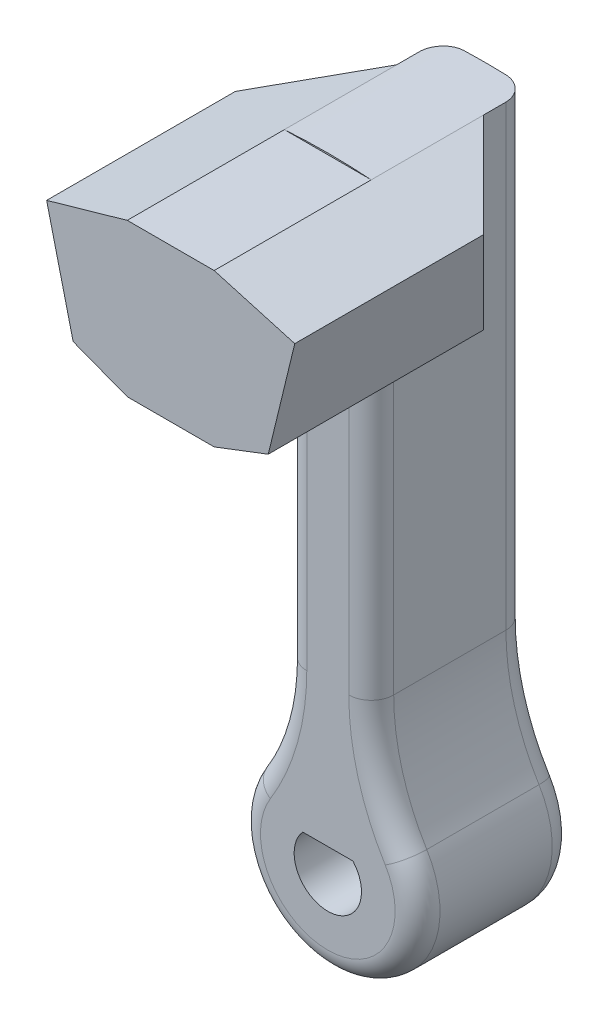
ISO-10303-21;
HEADER;
FILE_DESCRIPTION(('STEP AP214'),'2;1');
FILE_NAME('part.step','',(''),(''),'','','');
FILE_SCHEMA(('AUTOMOTIVE_DESIGN { 1 0 10303 214 1 1 1 1 }'));
ENDSEC;
DATA;
#1=APPLICATION_CONTEXT('core data for automotive mechanical design processes');
#2=APPLICATION_PROTOCOL_DEFINITION('international standard','automotive_design',2000,#1);
#3=PRODUCT_CONTEXT('',#1,'mechanical');
#4=PRODUCT('Part','Part','',(#3));
#5=PRODUCT_RELATED_PRODUCT_CATEGORY('part','',(#4));
#6=PRODUCT_DEFINITION_FORMATION('','',#4);
#7=PRODUCT_DEFINITION_CONTEXT('part definition',#1,'design');
#8=PRODUCT_DEFINITION('design','',#6,#7);
#9=PRODUCT_DEFINITION_SHAPE('','',#8);
#10=(LENGTH_UNIT() NAMED_UNIT(*) SI_UNIT(.MILLI.,.METRE.));
#11=(NAMED_UNIT(*) PLANE_ANGLE_UNIT() SI_UNIT($,.RADIAN.));
#12=(NAMED_UNIT(*) SI_UNIT($,.STERADIAN.) SOLID_ANGLE_UNIT());
#13=UNCERTAINTY_MEASURE_WITH_UNIT(LENGTH_MEASURE(1.E-05),#10,'distance_accuracy_value','');
#14=(GEOMETRIC_REPRESENTATION_CONTEXT(3) GLOBAL_UNCERTAINTY_ASSIGNED_CONTEXT((#13)) GLOBAL_UNIT_ASSIGNED_CONTEXT((#10,
#11,#12)) REPRESENTATION_CONTEXT('',''));
#15=CARTESIAN_POINT('',(0.,0.,0.));
#16=DIRECTION('',(0.,0.,1.));
#17=DIRECTION('',(1.,0.,0.));
#18=AXIS2_PLACEMENT_3D('',#15,#16,#17);
#19=CARTESIAN_POINT('',(-27.2528800262718,-5.01688961354067,21.2500000985339));
#20=DIRECTION('',(0.,0.,1.));
#21=DIRECTION('',(1.,0.,0.));
#22=AXIS2_PLACEMENT_3D('',#19,#20,#21);
#23=PLANE('',#22);
#24=CARTESIAN_POINT('',(-27.2528800262718,-5.01688961354067,21.2500000985339));
#25=DIRECTION('',(0.,0.,-1.));
#26=DIRECTION('',(-1.,0.,0.));
#27=AXIS2_PLACEMENT_3D('',#24,#25,#26);
#28=CIRCLE('',#27,27.7611237041775);
#29=CARTESIAN_POINT('',(-29.1893716993755,22.6766112362733,21.2500000985339));
#30=VERTEX_POINT('',#29);
#31=CARTESIAN_POINT('',(-25.316388353168,22.6766112362733,21.2500000985339));
#32=VERTEX_POINT('',#31);
#33=EDGE_CURVE('E146',#30,#32,#28,.T.);
#34=ORIENTED_EDGE('',*,*,#33,.F.);
#35=DIRECTION('',(1.,0.,0.));
#36=VECTOR('',#35,1.);
#37=CARTESIAN_POINT('',(-25.316388353168,22.6766112362733,21.2500000985339));
#38=LINE('',#37,#36);
#39=EDGE_CURVE('E157',#30,#32,#38,.T.);
#40=ORIENTED_EDGE('',*,*,#39,.T.);
#41=EDGE_LOOP('',(#34,#40));
#42=FACE_BOUND('',#41,.T.);
#43=ADVANCED_FACE('F43',(#42),#23,.T.);
#44=CARTESIAN_POINT('',(-27.2528800262718,-5.01688961354067,21.2500000985339));
#45=DIRECTION('',(0.,0.,1.));
#46=DIRECTION('',(1.,0.,0.));
#47=AXIS2_PLACEMENT_3D('',#44,#45,#46);
#48=CIRCLE('',#47,1.5);
#49=CARTESIAN_POINT('',(-28.3709140150216,-4.01688961354067,21.2500000985339));
#50=VERTEX_POINT('',#49);
#51=CARTESIAN_POINT('',(-26.1348460375219,-4.01688961354067,21.2500000985339));
#52=VERTEX_POINT('',#51);
#53=EDGE_CURVE('E193',#50,#52,#48,.T.);
#54=ORIENTED_EDGE('',*,*,#53,.F.);
#55=DIRECTION('',(-1.,0.,0.));
#56=VECTOR('',#55,1.);
#57=CARTESIAN_POINT('',(-26.1348460375219,-4.01688961354067,21.2500000985339));
#58=LINE('',#57,#56);
#59=EDGE_CURVE('E200',#52,#50,#58,.T.);
#60=ORIENTED_EDGE('',*,*,#59,.F.);
#61=EDGE_LOOP('',(#54,#60));
#62=FACE_BOUND('',#61,.T.);
#63=CARTESIAN_POINT('',(-15.316388353168,2.29885823189016,21.2500000985339));
#64=DIRECTION('',(0.,0.,1.));
#65=DIRECTION('',(1.,0.,0.));
#66=AXIS2_PLACEMENT_3D('',#63,#64,#65);
#67=CIRCLE('',#66,11.);
#68=CARTESIAN_POINT('',(-24.6950603820352,-3.44922936094834,21.2500000985339));
#69=VERTEX_POINT('',#68);
#70=CARTESIAN_POINT('',(-26.316388353168,2.29885823189016,21.2500000985339));
#71=VERTEX_POINT('',#70);
#72=EDGE_CURVE('E366',#69,#71,#67,.F.);
#73=ORIENTED_EDGE('',*,*,#72,.T.);
#74=DIRECTION('',(0.,-1.,0.));
#75=VECTOR('',#74,1.);
#76=CARTESIAN_POINT('',(-26.316388353168,-5.01688961354067,21.2500000985339));
#77=LINE('',#76,#75);
#78=CARTESIAN_POINT('',(-26.316388353168,15.8699735180172,21.2500000985339));
#79=VERTEX_POINT('',#78);
#80=EDGE_CURVE('E369',#71,#79,#77,.F.);
#81=ORIENTED_EDGE('',*,*,#80,.T.);
#82=DIRECTION('',(-1.,0.,0.));
#83=VECTOR('',#82,1.);
#84=CARTESIAN_POINT('',(-25.316388353168,15.8699735180172,21.2500000985339));
#85=LINE('',#84,#83);
#86=CARTESIAN_POINT('',(-28.1893716993755,15.8699735180172,21.2500000985339));
#87=VERTEX_POINT('',#86);
#88=EDGE_CURVE('E163',#79,#87,#85,.T.);
#89=ORIENTED_EDGE('',*,*,#88,.T.);
#90=DIRECTION('',(0.,1.,0.));
#91=VECTOR('',#90,1.);
#92=CARTESIAN_POINT('',(-28.1893716993755,-5.01688961354067,21.2500000985339));
#93=LINE('',#92,#91);
#94=CARTESIAN_POINT('',(-28.1893716993755,2.29885823189016,21.2500000985339));
#95=VERTEX_POINT('',#94);
#96=EDGE_CURVE('E357',#87,#95,#93,.F.);
#97=ORIENTED_EDGE('',*,*,#96,.T.);
#98=CARTESIAN_POINT('',(-39.1893716993755,2.29885823189016,21.2500000985339));
#99=DIRECTION('',(0.,0.,1.));
#100=DIRECTION('',(1.,0.,0.));
#101=AXIS2_PLACEMENT_3D('',#98,#99,#100);
#102=CIRCLE('',#101,11.);
#103=CARTESIAN_POINT('',(-29.8106996705083,-3.44922936094834,21.2500000985339));
#104=VERTEX_POINT('',#103);
#105=EDGE_CURVE('E360',#95,#104,#102,.F.);
#106=ORIENTED_EDGE('',*,*,#105,.T.);
#107=CARTESIAN_POINT('',(-27.2528800262718,-5.01688961354067,21.2500000985339));
#108=DIRECTION('',(0.,0.,1.));
#109=DIRECTION('',(1.,0.,0.));
#110=AXIS2_PLACEMENT_3D('',#107,#108,#109);
#111=CIRCLE('',#110,3.);
#112=EDGE_CURVE('E363',#104,#69,#111,.T.);
#113=ORIENTED_EDGE('',*,*,#112,.T.);
#114=EDGE_LOOP('',(#73,#81,#89,#97,#106,#113));
#115=FACE_BOUND('',#114,.T.);
#116=ADVANCED_FACE('F295',(#62,#115),#23,.T.);
#117=CARTESIAN_POINT('',(-27.2528800262718,-5.01688961354067,14.2500000985339));
#118=DIRECTION('',(0.,0.,1.));
#119=DIRECTION('',(1.,0.,0.));
#120=AXIS2_PLACEMENT_3D('',#117,#118,#119);
#121=CYLINDRICAL_SURFACE('',#120,4.);
#122=DIRECTION('',(0.,0.,1.));
#123=VECTOR('',#122,1.);
#124=CARTESIAN_POINT('',(-23.8424538339564,-2.92667594341757,14.2500000985339));
#125=LINE('',#124,#123);
#126=CARTESIAN_POINT('',(-23.8424538339564,-2.92667594341757,15.2500000985339));
#127=VERTEX_POINT('',#126);
#128=CARTESIAN_POINT('',(-23.8424538339564,-2.92667594341757,20.2500000985339));
#129=VERTEX_POINT('',#128);
#130=EDGE_CURVE('E216',#127,#129,#125,.T.);
#131=ORIENTED_EDGE('',*,*,#130,.T.);
#132=CARTESIAN_POINT('',(-27.2528800262718,-5.01688961354067,20.2500000985339));
#133=DIRECTION('',(0.,0.,1.));
#134=DIRECTION('',(1.,0.,0.));
#135=AXIS2_PLACEMENT_3D('',#132,#133,#134);
#136=CIRCLE('',#135,4.);
#137=CARTESIAN_POINT('',(-30.6633062185871,-2.92667594341757,20.2500000985339));
#138=VERTEX_POINT('',#137);
#139=EDGE_CURVE('E375',#129,#138,#136,.F.);
#140=ORIENTED_EDGE('',*,*,#139,.T.);
#141=DIRECTION('',(0.,0.,1.));
#142=VECTOR('',#141,1.);
#143=CARTESIAN_POINT('',(-30.6633062185871,-2.92667594341757,14.2500000985339));
#144=LINE('',#143,#142);
#145=CARTESIAN_POINT('',(-30.6633062185871,-2.92667594341757,15.2500000985339));
#146=VERTEX_POINT('',#145);
#147=EDGE_CURVE('E219',#138,#146,#144,.F.);
#148=ORIENTED_EDGE('',*,*,#147,.T.);
#149=CARTESIAN_POINT('',(-27.2528800262718,-5.01688961354067,15.2500000985339));
#150=DIRECTION('',(0.,0.,1.));
#151=DIRECTION('',(1.,0.,0.));
#152=AXIS2_PLACEMENT_3D('',#149,#150,#151);
#153=CIRCLE('',#152,4.);
#154=EDGE_CURVE('E340',#146,#127,#153,.T.);
#155=ORIENTED_EDGE('',*,*,#154,.T.);
#156=EDGE_LOOP('',(#131,#140,#148,#155));
#157=FACE_BOUND('',#156,.T.);
#158=ADVANCED_FACE('F302',(#157),#121,.T.);
#159=CARTESIAN_POINT('',(-27.2528800262718,-5.01688961354067,14.2500000985339));
#160=DIRECTION('',(0.,0.,1.));
#161=DIRECTION('',(1.,0.,0.));
#162=AXIS2_PLACEMENT_3D('',#159,#160,#161);
#163=PLANE('',#162);
#164=DIRECTION('',(-1.,0.,0.));
#165=VECTOR('',#164,1.);
#166=CARTESIAN_POINT('',(-26.1348460375219,-4.01688961354067,14.2500000985339));
#167=LINE('',#166,#165);
#168=CARTESIAN_POINT('',(-26.1348460375219,-4.01688961354067,14.2500000985339));
#169=VERTEX_POINT('',#168);
#170=CARTESIAN_POINT('',(-28.3709140150216,-4.01688961354067,14.2500000985339));
#171=VERTEX_POINT('',#170);
#172=EDGE_CURVE('E199',#169,#171,#167,.T.);
#173=ORIENTED_EDGE('',*,*,#172,.T.);
#174=CARTESIAN_POINT('',(-27.2528800262718,-5.01688961354067,14.2500000985339));
#175=DIRECTION('',(0.,0.,1.));
#176=DIRECTION('',(1.,0.,0.));
#177=AXIS2_PLACEMENT_3D('',#174,#175,#176);
#178=CIRCLE('',#177,1.5);
#179=EDGE_CURVE('E196',#171,#169,#178,.T.);
#180=ORIENTED_EDGE('',*,*,#179,.T.);
#181=EDGE_LOOP('',(#173,#180));
#182=FACE_BOUND('',#181,.T.);
#183=CARTESIAN_POINT('',(-39.1893716993755,2.29885823189016,14.2500000985339));
#184=DIRECTION('',(0.,0.,1.));
#185=DIRECTION('',(1.,0.,0.));
#186=AXIS2_PLACEMENT_3D('',#183,#184,#185);
#187=CIRCLE('',#186,11.);
#188=CARTESIAN_POINT('',(-29.8106996705083,-3.44922936094834,14.2500000985339));
#189=VERTEX_POINT('',#188);
#190=CARTESIAN_POINT('',(-28.1893716993755,2.29885823189016,14.2500000985339));
#191=VERTEX_POINT('',#190);
#192=EDGE_CURVE('E234',#189,#191,#187,.T.);
#193=ORIENTED_EDGE('',*,*,#192,.T.);
#194=DIRECTION('',(0.,1.,0.));
#195=VECTOR('',#194,1.);
#196=CARTESIAN_POINT('',(-28.1893716993755,22.6766112362733,14.2500000985339));
#197=LINE('',#196,#195);
#198=CARTESIAN_POINT('',(-28.1893716993755,22.7284338242002,14.2500000985339));
#199=VERTEX_POINT('',#198);
#200=EDGE_CURVE('E237',#191,#199,#197,.T.);
#201=ORIENTED_EDGE('',*,*,#200,.T.);
#202=CARTESIAN_POINT('',(-27.2528800262718,-5.01688961354067,14.2500000985339));
#203=DIRECTION('',(0.,0.,-1.));
#204=DIRECTION('',(-1.,0.,0.));
#205=AXIS2_PLACEMENT_3D('',#202,#203,#204);
#206=CIRCLE('',#205,27.7611237041775);
#207=CARTESIAN_POINT('',(-26.316388353168,22.7284338242002,14.2500000985339));
#208=VERTEX_POINT('',#207);
#209=EDGE_CURVE('E177',#199,#208,#206,.T.);
#210=ORIENTED_EDGE('',*,*,#209,.T.);
#211=DIRECTION('',(0.,-1.,0.));
#212=VECTOR('',#211,1.);
#213=CARTESIAN_POINT('',(-26.316388353168,2.29885823189016,14.2500000985339));
#214=LINE('',#213,#212);
#215=CARTESIAN_POINT('',(-26.316388353168,2.29885823189016,14.2500000985339));
#216=VERTEX_POINT('',#215);
#217=EDGE_CURVE('E231',#208,#216,#214,.T.);
#218=ORIENTED_EDGE('',*,*,#217,.T.);
#219=CARTESIAN_POINT('',(-15.316388353168,2.29885823189016,14.2500000985339));
#220=DIRECTION('',(0.,0.,1.));
#221=DIRECTION('',(1.,0.,0.));
#222=AXIS2_PLACEMENT_3D('',#219,#220,#221);
#223=CIRCLE('',#222,11.);
#224=CARTESIAN_POINT('',(-24.6950603820352,-3.44922936094834,14.2500000985339));
#225=VERTEX_POINT('',#224);
#226=EDGE_CURVE('E228',#216,#225,#223,.T.);
#227=ORIENTED_EDGE('',*,*,#226,.T.);
#228=CARTESIAN_POINT('',(-27.2528800262718,-5.01688961354067,14.2500000985339));
#229=DIRECTION('',(0.,0.,1.));
#230=DIRECTION('',(1.,0.,0.));
#231=AXIS2_PLACEMENT_3D('',#228,#229,#230);
#232=CIRCLE('',#231,3.);
#233=EDGE_CURVE('E225',#225,#189,#232,.F.);
#234=ORIENTED_EDGE('',*,*,#233,.T.);
#235=EDGE_LOOP('',(#193,#201,#210,#218,#227,#234));
#236=FACE_BOUND('',#235,.T.);
#237=ADVANCED_FACE('F306',(#182,#236),#163,.F.);
#238=CARTESIAN_POINT('',(-27.2528800262718,-5.01688961354067,14.2500000985339));
#239=DIRECTION('',(0.,0.,1.));
#240=DIRECTION('',(1.,0.,0.));
#241=AXIS2_PLACEMENT_3D('',#238,#239,#240);
#242=CYLINDRICAL_SURFACE('',#241,1.5);
#243=ORIENTED_EDGE('',*,*,#53,.T.);
#244=DIRECTION('',(0.,0.,1.));
#245=VECTOR('',#244,1.);
#246=CARTESIAN_POINT('',(-26.1348460375219,-4.01688961354067,14.2500000985339));
#247=LINE('',#246,#245);
#248=EDGE_CURVE('E203',#169,#52,#247,.T.);
#249=ORIENTED_EDGE('',*,*,#248,.F.);
#250=ORIENTED_EDGE('',*,*,#179,.F.);
#251=DIRECTION('',(0.,0.,1.));
#252=VECTOR('',#251,1.);
#253=CARTESIAN_POINT('',(-28.3709140150216,-4.01688961354067,14.2500000985339));
#254=LINE('',#253,#252);
#255=EDGE_CURVE('E208',#171,#50,#254,.T.);
#256=ORIENTED_EDGE('',*,*,#255,.T.);
#257=EDGE_LOOP('',(#243,#249,#250,#256));
#258=FACE_BOUND('',#257,.T.);
#259=ADVANCED_FACE('F579',(#258),#242,.F.);
#260=CARTESIAN_POINT('',(-26.1348460375219,-4.01688961354067,14.2500000985339));
#261=DIRECTION('',(0.,1.,0.));
#262=DIRECTION('',(0.,0.,1.));
#263=AXIS2_PLACEMENT_3D('',#260,#261,#262);
#264=PLANE('',#263);
#265=ORIENTED_EDGE('',*,*,#59,.T.);
#266=ORIENTED_EDGE('',*,*,#255,.F.);
#267=ORIENTED_EDGE('',*,*,#172,.F.);
#268=ORIENTED_EDGE('',*,*,#248,.T.);
#269=EDGE_LOOP('',(#265,#266,#267,#268));
#270=FACE_BOUND('',#269,.T.);
#271=ADVANCED_FACE('F573',(#270),#264,.F.);
#272=CARTESIAN_POINT('',(-25.316388353168,-1.51688961354067,21.2500000985339));
#273=DIRECTION('',(1.,0.,0.));
#274=DIRECTION('',(0.,0.,-1.));
#275=AXIS2_PLACEMENT_3D('',#272,#273,#274);
#276=PLANE('',#275);
#277=DIRECTION('',(0.,0.,-1.));
#278=VECTOR('',#277,1.);
#279=CARTESIAN_POINT('',(-25.316388353168,22.6766112362733,21.2500000985339));
#280=LINE('',#279,#278);
#281=CARTESIAN_POINT('',(-25.316388353168,22.6766112362733,16.2500000985338));
#282=VERTEX_POINT('',#281);
#283=CARTESIAN_POINT('',(-25.316388353168,22.6766112362733,15.2500000985339));
#284=VERTEX_POINT('',#283);
#285=EDGE_CURVE('E141',#282,#284,#280,.T.);
#286=ORIENTED_EDGE('',*,*,#285,.F.);
#287=DIRECTION('',(0.,-1.,0.));
#288=VECTOR('',#287,1.);
#289=CARTESIAN_POINT('',(-25.316388353168,-1.51688961354067,16.2500000985338));
#290=LINE('',#289,#288);
#291=CARTESIAN_POINT('',(-25.316388353168,15.8699735180172,16.2500000985338));
#292=VERTEX_POINT('',#291);
#293=EDGE_CURVE('E125',#282,#292,#290,.T.);
#294=ORIENTED_EDGE('',*,*,#293,.T.);
#295=DIRECTION('',(0.,0.,1.));
#296=VECTOR('',#295,1.);
#297=CARTESIAN_POINT('',(-25.316388353168,15.8699735180172,28.2500000985339));
#298=LINE('',#297,#296);
#299=CARTESIAN_POINT('',(-25.316388353168,15.8699735180172,20.2500000985339));
#300=VERTEX_POINT('',#299);
#301=EDGE_CURVE('E388',#292,#300,#298,.T.);
#302=ORIENTED_EDGE('',*,*,#301,.T.);
#303=DIRECTION('',(0.,-1.,0.));
#304=VECTOR('',#303,1.);
#305=CARTESIAN_POINT('',(-25.316388353168,-1.51688961354067,20.2500000985339));
#306=LINE('',#305,#304);
#307=CARTESIAN_POINT('',(-25.316388353168,2.29885823189016,20.2500000985339));
#308=VERTEX_POINT('',#307);
#309=EDGE_CURVE('E354',#300,#308,#306,.T.);
#310=ORIENTED_EDGE('',*,*,#309,.T.);
#311=DIRECTION('',(0.,0.,-1.));
#312=VECTOR('',#311,1.);
#313=CARTESIAN_POINT('',(-25.316388353168,2.29885823189016,14.2500000985339));
#314=LINE('',#313,#312);
#315=CARTESIAN_POINT('',(-25.316388353168,2.29885823189016,15.2500000985339));
#316=VERTEX_POINT('',#315);
#317=EDGE_CURVE('E222',#308,#316,#314,.T.);
#318=ORIENTED_EDGE('',*,*,#317,.T.);
#319=DIRECTION('',(0.,-1.,0.));
#320=VECTOR('',#319,1.);
#321=CARTESIAN_POINT('',(-25.316388353168,22.6766112362733,15.2500000985339));
#322=LINE('',#321,#320);
#323=EDGE_CURVE('E419',#316,#284,#322,.F.);
#324=ORIENTED_EDGE('',*,*,#323,.T.);
#325=EDGE_LOOP('',(#286,#294,#302,#310,#318,#324));
#326=FACE_BOUND('',#325,.T.);
#327=ADVANCED_FACE('F417',(#326),#276,.T.);
#328=CARTESIAN_POINT('',(-27.2528800262718,-5.01688961354067,21.2500000985339));
#329=DIRECTION('',(0.,0.,-1.));
#330=DIRECTION('',(-1.,0.,0.));
#331=AXIS2_PLACEMENT_3D('',#328,#329,#330);
#332=CYLINDRICAL_SURFACE('',#331,27.7611237041775);
#333=ORIENTED_EDGE('',*,*,#209,.F.);
#334=CARTESIAN_POINT('',(-28.1893716993755,22.7284338242002,14.2500000985339));
#335=CARTESIAN_POINT('',(-28.2175305136495,22.727483616514,14.250000283334));
#336=CARTESIAN_POINT('',(-28.2456743107614,22.7264904633831,14.25119021774));
#337=CARTESIAN_POINT('',(-28.3017572146948,22.7244267119806,14.2559365975445));
#338=CARTESIAN_POINT('',(-28.3296963325388,22.7233561179135,14.2594929145473));
#339=CARTESIAN_POINT('',(-28.4128562957079,22.720044383255,14.2736762905036));
#340=CARTESIAN_POINT('',(-28.4675152811673,22.7177000490201,14.2878178748619));
#341=CARTESIAN_POINT('',(-28.5736717658038,22.712847702948,14.3250764911571));
#342=CARTESIAN_POINT('',(-28.6251678289904,22.7103396178171,14.3481975654714));
#343=CARTESIAN_POINT('',(-28.7235439225742,22.705295786182,14.4027567787848));
#344=CARTESIAN_POINT('',(-28.7704246889516,22.70276004416,14.4341935887543));
#345=CARTESIAN_POINT('',(-28.8582684486962,22.6978115071917,14.5045168683193));
#346=CARTESIAN_POINT('',(-28.8992280359975,22.6953987835221,14.5434075959872));
#347=CARTESIAN_POINT('',(-28.9740437140589,22.690852864917,14.627538423488));
#348=CARTESIAN_POINT('',(-29.0078984517954,22.688719723253,14.672779729971));
#349=CARTESIAN_POINT('',(-29.0675101289866,22.6848793187738,14.7682930571502));
#350=CARTESIAN_POINT('',(-29.0932713117541,22.683171832892,14.8185624234327));
#351=CARTESIAN_POINT('',(-29.1359705465781,22.6803019456421,14.9227181573657));
#352=CARTESIAN_POINT('',(-29.1529140024266,22.6791392104767,14.9766022868571));
#353=CARTESIAN_POINT('',(-29.1732380932151,22.67773583336,15.067353019943));
#354=CARTESIAN_POINT('',(-29.179284384038,22.6773152606612,15.1036421819719));
#355=CARTESIAN_POINT('',(-29.1873506966176,22.6767525673461,15.1766157593571));
#356=CARTESIAN_POINT('',(-29.1893763487023,22.6766100573475,15.2132995495624));
#357=CARTESIAN_POINT('',(-29.1893716993755,22.6766112362733,15.2500000985339));
#358=B_SPLINE_CURVE_WITH_KNOTS('',3,(#334,#335,#336,#337,#338,#339,#340,#341,#342,#343,#344,
#345,#346,#347,#348,#349,#350,#351,#352,#353,#354,#355,#356,#357),.UNSPECIFIED.,.F.,.F.,(4,2,2,
2,2,2,2,2,2,2,2,4),(0.,0.0844724758350371,0.168940368717516,0.337593051041958,0.506321745425528,
0.675023489684942,0.843821894101273,1.01265241480505,1.18139427226116,1.35003259703966,
1.46019989151751,1.57021280334722),.UNSPECIFIED.);
#359=CARTESIAN_POINT('',(-29.1893716993755,22.6766112362733,15.2500000985339));
#360=VERTEX_POINT('',#359);
#361=EDGE_CURVE('E248',#199,#360,#358,.T.);
#362=ORIENTED_EDGE('',*,*,#361,.T.);
#363=DIRECTION('',(0.,0.,-1.));
#364=VECTOR('',#363,1.);
#365=CARTESIAN_POINT('',(-29.1893716993755,22.6766112362733,21.2500000985339));
#366=LINE('',#365,#364);
#367=CARTESIAN_POINT('',(-29.1893716993754,22.6766112362733,16.2500000985338));
#368=VERTEX_POINT('',#367);
#369=EDGE_CURVE('E189',#368,#360,#366,.T.);
#370=ORIENTED_EDGE('',*,*,#369,.F.);
#371=DIRECTION('',(0.,0.,-1.));
#372=VECTOR('',#371,1.);
#373=CARTESIAN_POINT('',(-29.1893716993755,22.6766112362733,21.2500000985339));
#374=LINE('',#373,#372);
#375=EDGE_CURVE('E11',#30,#368,#374,.T.);
#376=ORIENTED_EDGE('',*,*,#375,.F.);
#377=ORIENTED_EDGE('',*,*,#33,.T.);
#378=DIRECTION('',(0.,0.,-1.));
#379=VECTOR('',#378,1.);
#380=CARTESIAN_POINT('',(-25.316388353168,22.6766112362733,21.2500000985339));
#381=LINE('',#380,#379);
#382=EDGE_CURVE('E53',#32,#282,#381,.T.);
#383=ORIENTED_EDGE('',*,*,#382,.T.);
#384=ORIENTED_EDGE('',*,*,#285,.T.);
#385=CARTESIAN_POINT('',(-25.316388353168,22.6766112362733,15.2500000985339));
#386=CARTESIAN_POINT('',(-25.3163885013359,22.6766109997974,15.2219078625601));
#387=CARTESIAN_POINT('',(-25.3175728584396,22.676694091457,15.1938291104635));
#388=CARTESIAN_POINT('',(-25.3222974832878,22.6770239531374,15.1378730717198));
#389=CARTESIAN_POINT('',(-25.325837621406,22.6772707141523,15.1099957740731));
#390=CARTESIAN_POINT('',(-25.3399567847837,22.6782509130357,15.027019278689));
#391=CARTESIAN_POINT('',(-25.354034660096,22.6792242875354,14.9724767448322));
#392=CARTESIAN_POINT('',(-25.3911250590409,22.6817421062743,14.8665377381451));
#393=CARTESIAN_POINT('',(-25.4141415676779,22.6832868052055,14.8151426803643));
#394=CARTESIAN_POINT('',(-25.4684493196462,22.6868381851682,14.7169476037725));
#395=CARTESIAN_POINT('',(-25.4997393435365,22.688844798112,14.670146909187));
#396=CARTESIAN_POINT('',(-25.5697529258118,22.693186182626,14.582399169685));
#397=CARTESIAN_POINT('',(-25.6084864283412,22.6955213920555,14.5414600847429));
#398=CARTESIAN_POINT('',(-25.692272830636,22.7003658708093,14.4666522077536));
#399=CARTESIAN_POINT('',(-25.7373270065135,22.7028751752305,14.4327848468962));
#400=CARTESIAN_POINT('',(-25.8325685529558,22.707918433572,14.3730241902967));
#401=CARTESIAN_POINT('',(-25.8827662766675,22.7104524275348,14.3471474155854));
#402=CARTESIAN_POINT('',(-25.9867905951096,22.7153968158427,14.3042058469147));
#403=CARTESIAN_POINT('',(-26.0406150481882,22.7178072816782,14.2871359030315));
#404=CARTESIAN_POINT('',(-26.1316999872173,22.7216082385369,14.2664994126187));
#405=CARTESIAN_POINT('',(-26.1683862243911,22.7230673684414,14.2603165351132));
#406=CARTESIAN_POINT('',(-26.2421717146718,22.7258541799688,14.2520672962831));
#407=CARTESIAN_POINT('',(-26.2792703232176,22.7271820413836,14.2499952282301));
#408=CARTESIAN_POINT('',(-26.316388353168,22.7284338242002,14.2500000985339));
#409=B_SPLINE_CURVE_WITH_KNOTS('',3,(#385,#386,#387,#388,#389,#390,#391,#392,#393,#394,#395,
#396,#397,#398,#399,#400,#401,#402,#403,#404,#405,#406,#407,#408),.UNSPECIFIED.,.F.,.F.,(4,2,2,
2,2,2,2,2,2,2,2,4),(0.,0.084224858384645,0.168445082701027,0.336593106195838,0.504816179334476,
0.673014471727288,0.841439051352123,1.0098976841157,1.17870231881688,1.34740813032369,
1.45888989707973,1.57021679346873),.UNSPECIFIED.);
#410=EDGE_CURVE('E240',#284,#208,#409,.T.);
#411=ORIENTED_EDGE('',*,*,#410,.T.);
#412=EDGE_LOOP('',(#333,#362,#370,#376,#377,#383,#384,#411));
#413=FACE_BOUND('',#412,.T.);
#414=ADVANCED_FACE('F138',(#413),#332,.T.);
#415=CARTESIAN_POINT('',(-29.1893716993755,-1.51688961354067,21.2500000985339));
#416=DIRECTION('',(-1.,0.,0.));
#417=DIRECTION('',(0.,0.,1.));
#418=AXIS2_PLACEMENT_3D('',#415,#416,#417);
#419=PLANE('',#418);
#420=DIRECTION('',(0.,0.,-1.));
#421=VECTOR('',#420,1.);
#422=CARTESIAN_POINT('',(-29.1893716993755,15.8699735180172,28.2500000985339));
#423=LINE('',#422,#421);
#424=CARTESIAN_POINT('',(-29.1893716993755,15.8699735180172,20.2500000985339));
#425=VERTEX_POINT('',#424);
#426=CARTESIAN_POINT('',(-29.1893716993755,15.8699735180172,16.2500000985338));
#427=VERTEX_POINT('',#426);
#428=EDGE_CURVE('E404',#425,#427,#423,.T.);
#429=ORIENTED_EDGE('',*,*,#428,.T.);
#430=DIRECTION('',(0.,1.,0.));
#431=VECTOR('',#430,1.);
#432=CARTESIAN_POINT('',(-29.1893716993755,-1.51688961354067,16.2500000985338));
#433=LINE('',#432,#431);
#434=EDGE_CURVE('E407',#427,#368,#433,.T.);
#435=ORIENTED_EDGE('',*,*,#434,.T.);
#436=ORIENTED_EDGE('',*,*,#369,.T.);
#437=DIRECTION('',(0.,1.,0.));
#438=VECTOR('',#437,1.);
#439=CARTESIAN_POINT('',(-29.1893716993755,2.29885823189016,15.2500000985339));
#440=LINE('',#439,#438);
#441=CARTESIAN_POINT('',(-29.1893716993755,2.29885823189016,15.2500000985339));
#442=VERTEX_POINT('',#441);
#443=EDGE_CURVE('E492',#360,#442,#440,.F.);
#444=ORIENTED_EDGE('',*,*,#443,.T.);
#445=DIRECTION('',(0.,0.,-1.));
#446=VECTOR('',#445,1.);
#447=CARTESIAN_POINT('',(-29.1893716993755,2.29885823189016,21.2500000985339));
#448=LINE('',#447,#446);
#449=CARTESIAN_POINT('',(-29.1893716993755,2.29885823189016,20.2500000985339));
#450=VERTEX_POINT('',#449);
#451=EDGE_CURVE('E211',#442,#450,#448,.F.);
#452=ORIENTED_EDGE('',*,*,#451,.T.);
#453=DIRECTION('',(0.,1.,0.));
#454=VECTOR('',#453,1.);
#455=CARTESIAN_POINT('',(-29.1893716993755,-1.51688961354067,20.2500000985339));
#456=LINE('',#455,#454);
#457=EDGE_CURVE('E380',#450,#425,#456,.T.);
#458=ORIENTED_EDGE('',*,*,#457,.T.);
#459=EDGE_LOOP('',(#429,#435,#436,#444,#452,#458));
#460=FACE_BOUND('',#459,.T.);
#461=ADVANCED_FACE('F491',(#460),#419,.T.);
#462=CARTESIAN_POINT('',(-25.316388353168,22.6766112362733,28.2500000985339));
#463=DIRECTION('',(0.,1.,0.));
#464=DIRECTION('',(0.,0.,1.));
#465=AXIS2_PLACEMENT_3D('',#462,#463,#464);
#466=PLANE('',#465);
#467=ORIENTED_EDGE('',*,*,#39,.F.);
#468=DIRECTION('',(0.,0.,-1.));
#469=VECTOR('',#468,1.);
#470=CARTESIAN_POINT('',(-29.1893716993755,22.6766112362733,28.2500000985339));
#471=LINE('',#470,#469);
#472=CARTESIAN_POINT('',(-29.1893716993755,22.6766112362733,28.2500000985339));
#473=VERTEX_POINT('',#472);
#474=EDGE_CURVE('E174',#473,#30,#471,.T.);
#475=ORIENTED_EDGE('',*,*,#474,.F.);
#476=DIRECTION('',(1.,0.,0.));
#477=VECTOR('',#476,1.);
#478=CARTESIAN_POINT('',(-25.316388353168,22.6766112362733,28.2500000985339));
#479=LINE('',#478,#477);
#480=CARTESIAN_POINT('',(-25.316388353168,22.6766112362733,28.2500000985339));
#481=VERTEX_POINT('',#480);
#482=EDGE_CURVE('E159',#473,#481,#479,.T.);
#483=ORIENTED_EDGE('',*,*,#482,.T.);
#484=DIRECTION('',(0.,0.,-1.));
#485=VECTOR('',#484,1.);
#486=CARTESIAN_POINT('',(-25.316388353168,22.6766112362733,28.2500000985339));
#487=LINE('',#486,#485);
#488=EDGE_CURVE('E117',#481,#32,#487,.T.);
#489=ORIENTED_EDGE('',*,*,#488,.T.);
#490=EDGE_LOOP('',(#467,#475,#483,#489));
#491=FACE_BOUND('',#490,.T.);
#492=ADVANCED_FACE('F155',(#491),#466,.T.);
#493=CARTESIAN_POINT('',(-29.1893716993755,22.6766112362733,28.2500000985339));
#494=DIRECTION('',(-0.274356183555775,0.961628142550284,0.));
#495=DIRECTION('',(-0.961628142550284,-0.274356183555775,0.));
#496=AXIS2_PLACEMENT_3D('',#493,#494,#495);
#497=PLANE('',#496);
#498=ORIENTED_EDGE('',*,*,#474,.T.);
#499=ORIENTED_EDGE('',*,*,#375,.T.);
#500=DIRECTION('',(-0.693142303576296,-0.197756147782776,0.693142303576303));
#501=VECTOR('',#500,1.);
#502=CARTESIAN_POINT('',(-32.5056511144321,21.7304640472917,19.5662795135905));
#503=LINE('',#502,#501);
#504=CARTESIAN_POINT('',(-32.7809434693488,21.6519220865118,19.8415718685072));
#505=VERTEX_POINT('',#504);
#506=EDGE_CURVE('E81',#368,#505,#503,.T.);
#507=ORIENTED_EDGE('',*,*,#506,.T.);
#508=DIRECTION('',(0.,0.,-1.));
#509=VECTOR('',#508,1.);
#510=CARTESIAN_POINT('',(-32.7809434693488,21.6519220865118,28.2500000985339));
#511=LINE('',#510,#509);
#512=CARTESIAN_POINT('',(-32.7809434693488,21.6519220865118,28.2500000985339));
#513=VERTEX_POINT('',#512);
#514=EDGE_CURVE('E178',#513,#505,#511,.T.);
#515=ORIENTED_EDGE('',*,*,#514,.F.);
#516=DIRECTION('',(0.961628142550284,0.274356183555775,0.));
#517=VECTOR('',#516,1.);
#518=CARTESIAN_POINT('',(-29.1893716993755,22.6766112362733,28.2500000985339));
#519=LINE('',#518,#517);
#520=EDGE_CURVE('E160',#513,#473,#519,.T.);
#521=ORIENTED_EDGE('',*,*,#520,.T.);
#522=EDGE_LOOP('',(#498,#499,#507,#515,#521));
#523=FACE_BOUND('',#522,.T.);
#524=ADVANCED_FACE('F546',(#523),#497,.T.);
#525=CARTESIAN_POINT('',(-32.7809434693488,21.6519220865118,28.2500000985339));
#526=DIRECTION('',(-0.971701686778662,-0.236211413592788,0.));
#527=DIRECTION('',(0.236211413592788,-0.971701686778662,0.));
#528=AXIS2_PLACEMENT_3D('',#525,#526,#527);
#529=PLANE('',#528);
#530=ORIENTED_EDGE('',*,*,#514,.T.);
#531=DIRECTION('',(0.229885144286395,-0.945677345014062,-0.229885144286397));
#532=VECTOR('',#531,1.);
#533=CARTESIAN_POINT('',(-27.3645004296578,-0.629672007335015,14.4251288288162));
#534=LINE('',#533,#532);
#535=CARTESIAN_POINT('',(-31.5998864013849,16.7934136526185,18.6605148005433));
#536=VERTEX_POINT('',#535);
#537=EDGE_CURVE('E127',#505,#536,#534,.T.);
#538=ORIENTED_EDGE('',*,*,#537,.T.);
#539=DIRECTION('',(0.,0.,-1.));
#540=VECTOR('',#539,1.);
#541=CARTESIAN_POINT('',(-31.5998864013849,16.7934136526185,28.2500000985339));
#542=LINE('',#541,#540);
#543=CARTESIAN_POINT('',(-31.5998864013849,16.7934136526185,28.2500000985339));
#544=VERTEX_POINT('',#543);
#545=EDGE_CURVE('E181',#544,#536,#542,.T.);
#546=ORIENTED_EDGE('',*,*,#545,.F.);
#547=DIRECTION('',(-0.236211413592788,0.971701686778662,0.));
#548=VECTOR('',#547,1.);
#549=CARTESIAN_POINT('',(-32.7809434693488,21.6519220865118,28.2500000985339));
#550=LINE('',#549,#548);
#551=EDGE_CURVE('E540',#544,#513,#550,.T.);
#552=ORIENTED_EDGE('',*,*,#551,.T.);
#553=EDGE_LOOP('',(#530,#538,#546,#552));
#554=FACE_BOUND('',#553,.T.);
#555=ADVANCED_FACE('F552',(#554),#529,.T.);
#556=CARTESIAN_POINT('',(-31.5998864013849,16.7934136526185,28.2500000985339));
#557=DIRECTION('',(-0.357736553966534,-0.933822551642521,0.));
#558=DIRECTION('',(0.933822551642521,-0.357736553966534,0.));
#559=AXIS2_PLACEMENT_3D('',#556,#557,#558);
#560=PLANE('',#559);
#561=ORIENTED_EDGE('',*,*,#545,.T.);
#562=DIRECTION('',(0.682509321182637,-0.261461379552742,-0.682509321182644));
#563=VECTOR('',#562,1.);
#564=CARTESIAN_POINT('',(-26.0866889523704,14.6813718591552,13.1473173515287));
#565=LINE('',#564,#563);
#566=EDGE_CURVE('E133',#536,#427,#565,.T.);
#567=ORIENTED_EDGE('',*,*,#566,.T.);
#568=ORIENTED_EDGE('',*,*,#428,.F.);
#569=DIRECTION('',(0.,0.,-1.));
#570=VECTOR('',#569,1.);
#571=CARTESIAN_POINT('',(-29.1893716993755,15.8699735180172,28.2500000985339));
#572=LINE('',#571,#570);
#573=CARTESIAN_POINT('',(-29.1893716993755,15.8699735180172,28.2500000985339));
#574=VERTEX_POINT('',#573);
#575=EDGE_CURVE('E61',#574,#425,#572,.T.);
#576=ORIENTED_EDGE('',*,*,#575,.F.);
#577=DIRECTION('',(-0.933822551642521,0.357736553966534,0.));
#578=VECTOR('',#577,1.);
#579=CARTESIAN_POINT('',(-31.5998864013849,16.7934136526185,28.2500000985339));
#580=LINE('',#579,#578);
#581=EDGE_CURVE('E533',#574,#544,#580,.T.);
#582=ORIENTED_EDGE('',*,*,#581,.T.);
#583=EDGE_LOOP('',(#561,#567,#568,#576,#582));
#584=FACE_BOUND('',#583,.T.);
#585=ADVANCED_FACE('F549',(#584),#560,.T.);
#586=CARTESIAN_POINT('',(-25.316388353168,15.8699735180172,28.2500000985339));
#587=DIRECTION('',(0.,-1.,0.));
#588=DIRECTION('',(0.,0.,-1.));
#589=AXIS2_PLACEMENT_3D('',#586,#587,#588);
#590=PLANE('',#589);
#591=ORIENTED_EDGE('',*,*,#88,.F.);
#592=CARTESIAN_POINT('',(-26.316388353168,15.8699735180172,20.2500000985339));
#593=DIRECTION('',(0.,-1.,0.));
#594=DIRECTION('',(0.,0.,-1.));
#595=AXIS2_PLACEMENT_3D('',#592,#593,#594);
#596=CIRCLE('',#595,1.);
#597=EDGE_CURVE('E383',#79,#300,#596,.F.);
#598=ORIENTED_EDGE('',*,*,#597,.T.);
#599=DIRECTION('',(0.,0.,-1.));
#600=VECTOR('',#599,1.);
#601=CARTESIAN_POINT('',(-25.316388353168,15.8699735180172,28.2500000985339));
#602=LINE('',#601,#600);
#603=CARTESIAN_POINT('',(-25.316388353168,15.8699735180172,28.2500000985339));
#604=VERTEX_POINT('',#603);
#605=EDGE_CURVE('E184',#604,#300,#602,.T.);
#606=ORIENTED_EDGE('',*,*,#605,.F.);
#607=DIRECTION('',(-1.,0.,0.));
#608=VECTOR('',#607,1.);
#609=CARTESIAN_POINT('',(-25.316388353168,15.8699735180172,28.2500000985339));
#610=LINE('',#609,#608);
#611=EDGE_CURVE('E525',#604,#574,#610,.T.);
#612=ORIENTED_EDGE('',*,*,#611,.T.);
#613=ORIENTED_EDGE('',*,*,#575,.T.);
#614=CARTESIAN_POINT('',(-28.1893716993755,15.8699735180172,20.2500000985339));
#615=DIRECTION('',(0.,-1.,0.));
#616=DIRECTION('',(0.,0.,-1.));
#617=AXIS2_PLACEMENT_3D('',#614,#615,#616);
#618=CIRCLE('',#617,1.);
#619=EDGE_CURVE('E386',#425,#87,#618,.F.);
#620=ORIENTED_EDGE('',*,*,#619,.T.);
#621=EDGE_LOOP('',(#591,#598,#606,#612,#613,#620));
#622=FACE_BOUND('',#621,.T.);
#623=ADVANCED_FACE('F524',(#622),#590,.T.);
#624=CARTESIAN_POINT('',(-22.9058736511586,16.7934136526185,28.2500000985339));
#625=DIRECTION('',(0.357736553966534,-0.933822551642521,0.));
#626=DIRECTION('',(0.933822551642521,0.357736553966534,0.));
#627=AXIS2_PLACEMENT_3D('',#624,#625,#626);
#628=PLANE('',#627);
#629=ORIENTED_EDGE('',*,*,#605,.T.);
#630=ORIENTED_EDGE('',*,*,#301,.F.);
#631=DIRECTION('',(0.682509321182637,0.261461379552741,0.682509321182644));
#632=VECTOR('',#631,1.);
#633=CARTESIAN_POINT('',(-28.4190711001731,14.6813718591552,13.1473173515287));
#634=LINE('',#633,#632);
#635=CARTESIAN_POINT('',(-22.9058736511586,16.7934136526185,18.6605148005433));
#636=VERTEX_POINT('',#635);
#637=EDGE_CURVE('E91',#292,#636,#634,.T.);
#638=ORIENTED_EDGE('',*,*,#637,.T.);
#639=DIRECTION('',(0.,0.,-1.));
#640=VECTOR('',#639,1.);
#641=CARTESIAN_POINT('',(-22.9058736511586,16.7934136526185,28.2500000985339));
#642=LINE('',#641,#640);
#643=CARTESIAN_POINT('',(-22.9058736511586,16.7934136526185,28.2500000985339));
#644=VERTEX_POINT('',#643);
#645=EDGE_CURVE('E116',#644,#636,#642,.T.);
#646=ORIENTED_EDGE('',*,*,#645,.F.);
#647=DIRECTION('',(-0.933822551642521,-0.357736553966534,0.));
#648=VECTOR('',#647,1.);
#649=CARTESIAN_POINT('',(-22.9058736511586,16.7934136526185,28.2500000985339));
#650=LINE('',#649,#648);
#651=EDGE_CURVE('E530',#644,#604,#650,.T.);
#652=ORIENTED_EDGE('',*,*,#651,.T.);
#653=EDGE_LOOP('',(#629,#630,#638,#646,#652));
#654=FACE_BOUND('',#653,.T.);
#655=ADVANCED_FACE('F410',(#654),#628,.T.);
#656=CARTESIAN_POINT('',(-21.7248165831947,21.6519220865118,28.2500000985339));
#657=DIRECTION('',(0.971701686778662,-0.236211413592787,0.));
#658=DIRECTION('',(0.236211413592787,0.971701686778662,0.));
#659=AXIS2_PLACEMENT_3D('',#656,#657,#658);
#660=PLANE('',#659);
#661=ORIENTED_EDGE('',*,*,#645,.T.);
#662=DIRECTION('',(0.229885144286395,0.945677345014062,0.229885144286397));
#663=VECTOR('',#662,1.);
#664=CARTESIAN_POINT('',(-27.1412596228857,-0.629672007335023,14.4251288288162));
#665=LINE('',#664,#663);
#666=CARTESIAN_POINT('',(-21.7248165831947,21.6519220865118,19.8415718685072));
#667=VERTEX_POINT('',#666);
#668=EDGE_CURVE('E119',#636,#667,#665,.T.);
#669=ORIENTED_EDGE('',*,*,#668,.T.);
#670=DIRECTION('',(0.,0.,-1.));
#671=VECTOR('',#670,1.);
#672=CARTESIAN_POINT('',(-21.7248165831947,21.6519220865118,28.2500000985339));
#673=LINE('',#672,#671);
#674=CARTESIAN_POINT('',(-21.7248165831947,21.6519220865118,28.2500000985339));
#675=VERTEX_POINT('',#674);
#676=EDGE_CURVE('E102',#675,#667,#673,.T.);
#677=ORIENTED_EDGE('',*,*,#676,.F.);
#678=DIRECTION('',(-0.236211413592787,-0.971701686778662,0.));
#679=VECTOR('',#678,1.);
#680=CARTESIAN_POINT('',(-21.7248165831947,21.6519220865118,28.2500000985339));
#681=LINE('',#680,#679);
#682=EDGE_CURVE('E535',#675,#644,#681,.T.);
#683=ORIENTED_EDGE('',*,*,#682,.T.);
#684=EDGE_LOOP('',(#661,#669,#677,#683));
#685=FACE_BOUND('',#684,.T.);
#686=ADVANCED_FACE('F120',(#685),#660,.T.);
#687=CARTESIAN_POINT('',(-25.316388353168,22.6766112362733,28.2500000985339));
#688=DIRECTION('',(0.274356183555775,0.961628142550284,0.));
#689=DIRECTION('',(-0.961628142550284,0.274356183555775,0.));
#690=AXIS2_PLACEMENT_3D('',#687,#688,#689);
#691=PLANE('',#690);
#692=ORIENTED_EDGE('',*,*,#676,.T.);
#693=DIRECTION('',(-0.693142303576295,0.197756147782777,-0.693142303576303));
#694=VECTOR('',#693,1.);
#695=CARTESIAN_POINT('',(-22.0001089381114,21.7304640472917,19.5662795135905));
#696=LINE('',#695,#694);
#697=EDGE_CURVE('E107',#667,#282,#696,.T.);
#698=ORIENTED_EDGE('',*,*,#697,.T.);
#699=ORIENTED_EDGE('',*,*,#382,.F.);
#700=ORIENTED_EDGE('',*,*,#488,.F.);
#701=DIRECTION('',(0.961628142550284,-0.274356183555775,0.));
#702=VECTOR('',#701,1.);
#703=CARTESIAN_POINT('',(-25.316388353168,22.6766112362733,28.2500000985339));
#704=LINE('',#703,#702);
#705=EDGE_CURVE('E112',#481,#675,#704,.T.);
#706=ORIENTED_EDGE('',*,*,#705,.T.);
#707=EDGE_LOOP('',(#692,#698,#699,#700,#706));
#708=FACE_BOUND('',#707,.T.);
#709=ADVANCED_FACE('F104',(#708),#691,.T.);
#710=CARTESIAN_POINT('',(0.,0.,28.2500000985339));
#711=DIRECTION('',(0.,0.,1.));
#712=DIRECTION('',(1.,0.,0.));
#713=AXIS2_PLACEMENT_3D('',#710,#711,#712);
#714=PLANE('',#713);
#715=ORIENTED_EDGE('',*,*,#482,.F.);
#716=ORIENTED_EDGE('',*,*,#520,.F.);
#717=ORIENTED_EDGE('',*,*,#551,.F.);
#718=ORIENTED_EDGE('',*,*,#581,.F.);
#719=ORIENTED_EDGE('',*,*,#611,.F.);
#720=ORIENTED_EDGE('',*,*,#651,.F.);
#721=ORIENTED_EDGE('',*,*,#682,.F.);
#722=ORIENTED_EDGE('',*,*,#705,.F.);
#723=EDGE_LOOP('',(#715,#716,#717,#718,#719,#720,#721,#722));
#724=FACE_BOUND('',#723,.T.);
#725=ADVANCED_FACE('F314',(#724),#714,.T.);
#726=CARTESIAN_POINT('',(-39.1893716993755,2.29885823189016,14.2500000985339));
#727=DIRECTION('',(0.,0.,1.));
#728=DIRECTION('',(1.,0.,0.));
#729=AXIS2_PLACEMENT_3D('',#726,#727,#728);
#730=CYLINDRICAL_SURFACE('',#729,10.);
#731=ORIENTED_EDGE('',*,*,#147,.F.);
#732=CARTESIAN_POINT('',(-39.1893716993755,2.29885823189016,20.2500000985339));
#733=DIRECTION('',(0.,0.,1.));
#734=DIRECTION('',(1.,0.,0.));
#735=AXIS2_PLACEMENT_3D('',#732,#733,#734);
#736=CIRCLE('',#735,10.);
#737=EDGE_CURVE('E378',#138,#450,#736,.T.);
#738=ORIENTED_EDGE('',*,*,#737,.T.);
#739=ORIENTED_EDGE('',*,*,#451,.F.);
#740=CARTESIAN_POINT('',(-39.1893716993755,2.29885823189016,15.2500000985339));
#741=DIRECTION('',(0.,0.,1.));
#742=DIRECTION('',(1.,0.,0.));
#743=AXIS2_PLACEMENT_3D('',#740,#741,#742);
#744=CIRCLE('',#743,10.);
#745=EDGE_CURVE('E428',#442,#146,#744,.F.);
#746=ORIENTED_EDGE('',*,*,#745,.T.);
#747=EDGE_LOOP('',(#731,#738,#739,#746));
#748=FACE_BOUND('',#747,.T.);
#749=ADVANCED_FACE('F311',(#748),#730,.F.);
#750=CARTESIAN_POINT('',(-15.316388353168,2.29885823189016,14.2500000985339));
#751=DIRECTION('',(0.,0.,1.));
#752=DIRECTION('',(1.,0.,0.));
#753=AXIS2_PLACEMENT_3D('',#750,#751,#752);
#754=CYLINDRICAL_SURFACE('',#753,10.);
#755=ORIENTED_EDGE('',*,*,#317,.F.);
#756=CARTESIAN_POINT('',(-15.316388353168,2.29885823189016,20.2500000985339));
#757=DIRECTION('',(0.,0.,1.));
#758=DIRECTION('',(1.,0.,0.));
#759=AXIS2_PLACEMENT_3D('',#756,#757,#758);
#760=CIRCLE('',#759,10.);
#761=EDGE_CURVE('E372',#308,#129,#760,.T.);
#762=ORIENTED_EDGE('',*,*,#761,.T.);
#763=ORIENTED_EDGE('',*,*,#130,.F.);
#764=CARTESIAN_POINT('',(-15.316388353168,2.29885823189016,15.2500000985339));
#765=DIRECTION('',(0.,0.,1.));
#766=DIRECTION('',(1.,0.,0.));
#767=AXIS2_PLACEMENT_3D('',#764,#765,#766);
#768=CIRCLE('',#767,10.);
#769=EDGE_CURVE('E427',#127,#316,#768,.F.);
#770=ORIENTED_EDGE('',*,*,#769,.T.);
#771=EDGE_LOOP('',(#755,#762,#763,#770));
#772=FACE_BOUND('',#771,.T.);
#773=ADVANCED_FACE('F264',(#772),#754,.F.);
#774=CARTESIAN_POINT('',(-26.316388353168,-5.01688961354067,15.2500000985339));
#775=DIRECTION('',(0.,1.,0.));
#776=DIRECTION('',(0.,0.,1.));
#777=AXIS2_PLACEMENT_3D('',#774,#775,#776);
#778=CYLINDRICAL_SURFACE('',#777,1.);
#779=ORIENTED_EDGE('',*,*,#410,.F.);
#780=ORIENTED_EDGE('',*,*,#323,.F.);
#781=CARTESIAN_POINT('',(-26.316388353168,2.29885823189016,15.2500000985339));
#782=DIRECTION('',(0.,-1.,0.));
#783=DIRECTION('',(0.,0.,-1.));
#784=AXIS2_PLACEMENT_3D('',#781,#782,#783);
#785=CIRCLE('',#784,1.);
#786=EDGE_CURVE('E164',#216,#316,#785,.T.);
#787=ORIENTED_EDGE('',*,*,#786,.F.);
#788=ORIENTED_EDGE('',*,*,#217,.F.);
#789=EDGE_LOOP('',(#779,#780,#787,#788));
#790=FACE_BOUND('',#789,.T.);
#791=ADVANCED_FACE('F258',(#790),#778,.T.);
#792=CARTESIAN_POINT('',(-15.316388353168,2.29885823189016,15.2500000985339));
#793=DIRECTION('',(0.,0.,1.));
#794=DIRECTION('',(1.,0.,0.));
#795=AXIS2_PLACEMENT_3D('',#792,#793,#794);
#796=TOROIDAL_SURFACE('',#795,11.,1.);
#797=ORIENTED_EDGE('',*,*,#786,.T.);
#798=ORIENTED_EDGE('',*,*,#769,.F.);
#799=CARTESIAN_POINT('',(-24.6950603820352,-3.44922936094834,15.2500000985339));
#800=DIRECTION('',(0.522553417530772,-0.852606548078837,0.));
#801=DIRECTION('',(0.852606548078837,0.522553417530773,0.));
#802=AXIS2_PLACEMENT_3D('',#799,#800,#801);
#803=CIRCLE('',#802,1.);
#804=EDGE_CURVE('E169',#225,#127,#803,.T.);
#805=ORIENTED_EDGE('',*,*,#804,.F.);
#806=ORIENTED_EDGE('',*,*,#226,.F.);
#807=EDGE_LOOP('',(#797,#798,#805,#806));
#808=FACE_BOUND('',#807,.T.);
#809=ADVANCED_FACE('F263',(#808),#796,.T.);
#810=CARTESIAN_POINT('',(-27.2528800262718,-5.01688961354067,15.2500000985339));
#811=DIRECTION('',(0.,0.,1.));
#812=DIRECTION('',(1.,0.,0.));
#813=AXIS2_PLACEMENT_3D('',#810,#811,#812);
#814=TOROIDAL_SURFACE('',#813,3.,1.);
#815=ORIENTED_EDGE('',*,*,#804,.T.);
#816=ORIENTED_EDGE('',*,*,#154,.F.);
#817=CARTESIAN_POINT('',(-29.8106996705083,-3.44922936094834,15.2500000985339));
#818=DIRECTION('',(0.522553417530772,0.852606548078837,0.));
#819=DIRECTION('',(-0.852606548078837,0.522553417530773,0.));
#820=AXIS2_PLACEMENT_3D('',#817,#818,#819);
#821=CIRCLE('',#820,1.);
#822=EDGE_CURVE('E348',#189,#146,#821,.T.);
#823=ORIENTED_EDGE('',*,*,#822,.F.);
#824=ORIENTED_EDGE('',*,*,#233,.F.);
#825=EDGE_LOOP('',(#815,#816,#823,#824));
#826=FACE_BOUND('',#825,.T.);
#827=ADVANCED_FACE('F324',(#826),#814,.T.);
#828=CARTESIAN_POINT('',(-39.1893716993755,2.29885823189016,15.2500000985339));
#829=DIRECTION('',(0.,0.,1.));
#830=DIRECTION('',(1.,0.,0.));
#831=AXIS2_PLACEMENT_3D('',#828,#829,#830);
#832=TOROIDAL_SURFACE('',#831,11.,1.);
#833=ORIENTED_EDGE('',*,*,#822,.T.);
#834=ORIENTED_EDGE('',*,*,#745,.F.);
#835=CARTESIAN_POINT('',(-28.1893716993755,2.29885823189016,15.2500000985339));
#836=DIRECTION('',(0.,1.,0.));
#837=DIRECTION('',(0.,0.,1.));
#838=AXIS2_PLACEMENT_3D('',#835,#836,#837);
#839=CIRCLE('',#838,1.);
#840=EDGE_CURVE('E350',#191,#442,#839,.T.);
#841=ORIENTED_EDGE('',*,*,#840,.F.);
#842=ORIENTED_EDGE('',*,*,#192,.F.);
#843=EDGE_LOOP('',(#833,#834,#841,#842));
#844=FACE_BOUND('',#843,.T.);
#845=ADVANCED_FACE('F321',(#844),#832,.T.);
#846=CARTESIAN_POINT('',(-28.1893716993755,-5.01688961354067,15.2500000985339));
#847=DIRECTION('',(0.,-1.,0.));
#848=DIRECTION('',(0.,0.,-1.));
#849=AXIS2_PLACEMENT_3D('',#846,#847,#848);
#850=CYLINDRICAL_SURFACE('',#849,1.);
#851=ORIENTED_EDGE('',*,*,#840,.T.);
#852=ORIENTED_EDGE('',*,*,#443,.F.);
#853=ORIENTED_EDGE('',*,*,#361,.F.);
#854=ORIENTED_EDGE('',*,*,#200,.F.);
#855=EDGE_LOOP('',(#851,#852,#853,#854));
#856=FACE_BOUND('',#855,.T.);
#857=ADVANCED_FACE('F285',(#856),#850,.T.);
#858=CARTESIAN_POINT('',(-28.1893716993755,-1.51688961354067,20.2500000985339));
#859=DIRECTION('',(0.,1.,0.));
#860=DIRECTION('',(0.,0.,1.));
#861=AXIS2_PLACEMENT_3D('',#858,#859,#860);
#862=CYLINDRICAL_SURFACE('',#861,1.);
#863=ORIENTED_EDGE('',*,*,#619,.F.);
#864=ORIENTED_EDGE('',*,*,#457,.F.);
#865=CARTESIAN_POINT('',(-28.1893716993755,2.29885823189016,20.2500000985339));
#866=DIRECTION('',(0.,-1.,0.));
#867=DIRECTION('',(0.,0.,-1.));
#868=AXIS2_PLACEMENT_3D('',#865,#866,#867);
#869=CIRCLE('',#868,1.);
#870=EDGE_CURVE('E398',#95,#450,#869,.T.);
#871=ORIENTED_EDGE('',*,*,#870,.F.);
#872=ORIENTED_EDGE('',*,*,#96,.F.);
#873=EDGE_LOOP('',(#863,#864,#871,#872));
#874=FACE_BOUND('',#873,.T.);
#875=ADVANCED_FACE('F282',(#874),#862,.T.);
#876=CARTESIAN_POINT('',(-39.1893716993755,2.29885823189016,20.2500000985339));
#877=DIRECTION('',(0.,0.,1.));
#878=DIRECTION('',(1.,0.,0.));
#879=AXIS2_PLACEMENT_3D('',#876,#877,#878);
#880=TOROIDAL_SURFACE('',#879,11.,1.);
#881=ORIENTED_EDGE('',*,*,#870,.T.);
#882=ORIENTED_EDGE('',*,*,#737,.F.);
#883=CARTESIAN_POINT('',(-29.8106996705083,-3.44922936094834,20.2500000985339));
#884=DIRECTION('',(-0.522553417530774,-0.852606548078836,0.));
#885=DIRECTION('',(0.852606548078836,-0.522553417530774,0.));
#886=AXIS2_PLACEMENT_3D('',#883,#884,#885);
#887=CIRCLE('',#886,1.);
#888=EDGE_CURVE('E395',#104,#138,#887,.T.);
#889=ORIENTED_EDGE('',*,*,#888,.F.);
#890=ORIENTED_EDGE('',*,*,#105,.F.);
#891=EDGE_LOOP('',(#881,#882,#889,#890));
#892=FACE_BOUND('',#891,.T.);
#893=ADVANCED_FACE('F278',(#892),#880,.T.);
#894=CARTESIAN_POINT('',(-27.2528800262718,-5.01688961354067,20.2500000985339));
#895=DIRECTION('',(0.,0.,1.));
#896=DIRECTION('',(1.,0.,0.));
#897=AXIS2_PLACEMENT_3D('',#894,#895,#896);
#898=TOROIDAL_SURFACE('',#897,3.,1.);
#899=ORIENTED_EDGE('',*,*,#888,.T.);
#900=ORIENTED_EDGE('',*,*,#139,.F.);
#901=CARTESIAN_POINT('',(-24.6950603820352,-3.44922936094834,20.2500000985339));
#902=DIRECTION('',(-0.522553417530772,0.852606548078837,0.));
#903=DIRECTION('',(-0.852606548078837,-0.522553417530772,0.));
#904=AXIS2_PLACEMENT_3D('',#901,#902,#903);
#905=CIRCLE('',#904,1.);
#906=EDGE_CURVE('E392',#69,#129,#905,.T.);
#907=ORIENTED_EDGE('',*,*,#906,.F.);
#908=ORIENTED_EDGE('',*,*,#112,.F.);
#909=EDGE_LOOP('',(#899,#900,#907,#908));
#910=FACE_BOUND('',#909,.T.);
#911=ADVANCED_FACE('F274',(#910),#898,.T.);
#912=CARTESIAN_POINT('',(-15.316388353168,2.29885823189016,20.2500000985339));
#913=DIRECTION('',(0.,0.,1.));
#914=DIRECTION('',(1.,0.,0.));
#915=AXIS2_PLACEMENT_3D('',#912,#913,#914);
#916=TOROIDAL_SURFACE('',#915,11.,1.);
#917=ORIENTED_EDGE('',*,*,#906,.T.);
#918=ORIENTED_EDGE('',*,*,#761,.F.);
#919=CARTESIAN_POINT('',(-26.316388353168,2.29885823189016,20.2500000985339));
#920=DIRECTION('',(0.,1.,0.));
#921=DIRECTION('',(0.,0.,1.));
#922=AXIS2_PLACEMENT_3D('',#919,#920,#921);
#923=CIRCLE('',#922,1.);
#924=EDGE_CURVE('E389',#71,#308,#923,.T.);
#925=ORIENTED_EDGE('',*,*,#924,.F.);
#926=ORIENTED_EDGE('',*,*,#72,.F.);
#927=EDGE_LOOP('',(#917,#918,#925,#926));
#928=FACE_BOUND('',#927,.T.);
#929=ADVANCED_FACE('F270',(#928),#916,.T.);
#930=CARTESIAN_POINT('',(-26.316388353168,-1.51688961354067,20.2500000985339));
#931=DIRECTION('',(0.,-1.,0.));
#932=DIRECTION('',(0.,0.,-1.));
#933=AXIS2_PLACEMENT_3D('',#930,#931,#932);
#934=CYLINDRICAL_SURFACE('',#933,1.);
#935=ORIENTED_EDGE('',*,*,#597,.F.);
#936=ORIENTED_EDGE('',*,*,#80,.F.);
#937=ORIENTED_EDGE('',*,*,#924,.T.);
#938=ORIENTED_EDGE('',*,*,#309,.F.);
#939=EDGE_LOOP('',(#935,#936,#937,#938));
#940=FACE_BOUND('',#939,.T.);
#941=ADVANCED_FACE('F267',(#940),#934,.T.);
#942=CARTESIAN_POINT('',(-25.316388353168,-1.51688961354067,16.2500000985338));
#943=DIRECTION('',(-0.707106781186551,0.,0.707106781186544));
#944=DIRECTION('',(0.,-1.,0.));
#945=AXIS2_PLACEMENT_3D('',#942,#943,#944);
#946=PLANE('',#945);
#947=ORIENTED_EDGE('',*,*,#697,.F.);
#948=ORIENTED_EDGE('',*,*,#668,.F.);
#949=ORIENTED_EDGE('',*,*,#637,.F.);
#950=ORIENTED_EDGE('',*,*,#293,.F.);
#951=EDGE_LOOP('',(#947,#948,#949,#950));
#952=FACE_BOUND('',#951,.T.);
#953=ADVANCED_FACE('F123',(#952),#946,.F.);
#954=CARTESIAN_POINT('',(-29.1893716993755,-1.51688961354067,16.2500000985338));
#955=DIRECTION('',(0.707106781186551,0.,0.707106781186544));
#956=DIRECTION('',(0.,1.,0.));
#957=AXIS2_PLACEMENT_3D('',#954,#955,#956);
#958=PLANE('',#957);
#959=ORIENTED_EDGE('',*,*,#566,.F.);
#960=ORIENTED_EDGE('',*,*,#537,.F.);
#961=ORIENTED_EDGE('',*,*,#506,.F.);
#962=ORIENTED_EDGE('',*,*,#434,.F.);
#963=EDGE_LOOP('',(#959,#960,#961,#962));
#964=FACE_BOUND('',#963,.T.);
#965=ADVANCED_FACE('F46',(#964),#958,.F.);
#966=CLOSED_SHELL('',(#43,#116,#158,#237,#259,#271,#327,#414,#461,#492,#524,#555,#585,#623,#655,
#686,#709,#725,#749,#773,#791,#809,#827,#845,#857,#875,#893,#911,#929,#941,#953,#965));
#967=MANIFOLD_SOLID_BREP('B2',#966);
#968=ADVANCED_BREP_SHAPE_REPRESENTATION('',(#18,#967),#14);
#969=SHAPE_DEFINITION_REPRESENTATION(#9,#968);
ENDSEC;
END-ISO-10303-21;
